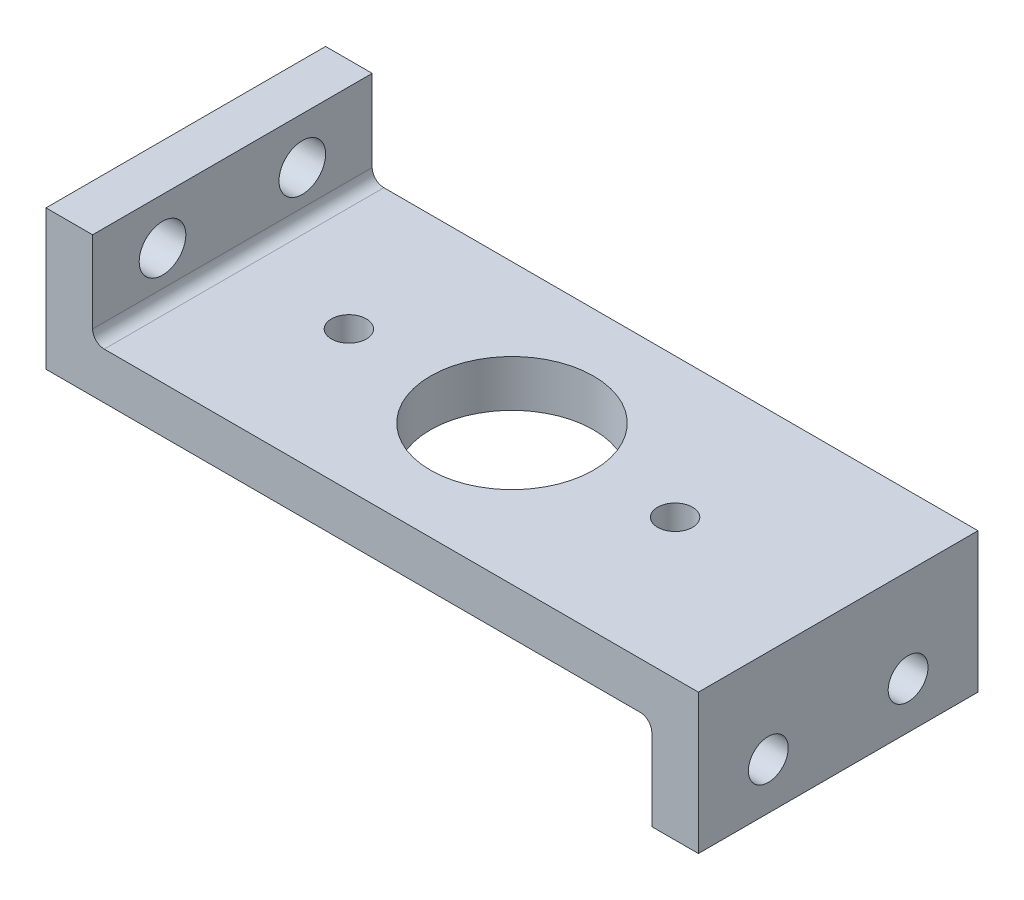
ISO-10303-21;
HEADER;
FILE_DESCRIPTION(('STEP AP214'),'2;1');
FILE_NAME('part.step','',(''),(''),'','','');
FILE_SCHEMA(('AUTOMOTIVE_DESIGN { 1 0 10303 214 1 1 1 1 }'));
ENDSEC;
DATA;
#1=APPLICATION_CONTEXT('core data for automotive mechanical design processes');
#2=APPLICATION_PROTOCOL_DEFINITION('international standard','automotive_design',2000,#1);
#3=PRODUCT_CONTEXT('',#1,'mechanical');
#4=PRODUCT('Part','Part','',(#3));
#5=PRODUCT_RELATED_PRODUCT_CATEGORY('part','',(#4));
#6=PRODUCT_DEFINITION_FORMATION('','',#4);
#7=PRODUCT_DEFINITION_CONTEXT('part definition',#1,'design');
#8=PRODUCT_DEFINITION('design','',#6,#7);
#9=PRODUCT_DEFINITION_SHAPE('','',#8);
#10=(LENGTH_UNIT() NAMED_UNIT(*) SI_UNIT(.MILLI.,.METRE.));
#11=(NAMED_UNIT(*) PLANE_ANGLE_UNIT() SI_UNIT($,.RADIAN.));
#12=(NAMED_UNIT(*) SI_UNIT($,.STERADIAN.) SOLID_ANGLE_UNIT());
#13=UNCERTAINTY_MEASURE_WITH_UNIT(LENGTH_MEASURE(1.E-05),#10,'distance_accuracy_value','');
#14=(GEOMETRIC_REPRESENTATION_CONTEXT(3) GLOBAL_UNCERTAINTY_ASSIGNED_CONTEXT((#13)) GLOBAL_UNIT_ASSIGNED_CONTEXT((#10,
#11,#12)) REPRESENTATION_CONTEXT('',''));
#15=CARTESIAN_POINT('',(0.,0.,0.));
#16=DIRECTION('',(0.,0.,1.));
#17=DIRECTION('',(1.,0.,0.));
#18=AXIS2_PLACEMENT_3D('',#15,#16,#17);
#19=CARTESIAN_POINT('',(-73.0250000000001,7.80727615005251,76.2));
#20=DIRECTION('',(0.,-1.,0.));
#21=DIRECTION('',(1.,0.,0.));
#22=AXIS2_PLACEMENT_3D('',#19,#20,#21);
#23=PLANE('',#22);
#24=CARTESIAN_POINT('',(44.4499999999999,7.80727615005251,38.1));
#25=DIRECTION('',(0.,-1.,0.));
#26=DIRECTION('',(1.,0.,0.));
#27=AXIS2_PLACEMENT_3D('',#24,#25,#26);
#28=CIRCLE('',#27,4.7625);
#29=CARTESIAN_POINT('',(49.2124999999999,7.80727615005251,38.1));
#30=VERTEX_POINT('',#29);
#31=EDGE_CURVE('E164',#30,#30,#28,.T.);
#32=ORIENTED_EDGE('',*,*,#31,.T.);
#33=EDGE_LOOP('',(#32));
#34=FACE_BOUND('',#33,.T.);
#35=CARTESIAN_POINT('',(-44.4500000000001,7.80727615005251,38.1));
#36=DIRECTION('',(0.,-1.,0.));
#37=DIRECTION('',(1.,0.,0.));
#38=AXIS2_PLACEMENT_3D('',#35,#36,#37);
#39=CIRCLE('',#38,4.7625);
#40=CARTESIAN_POINT('',(-39.6875000000001,7.80727615005251,38.1));
#41=VERTEX_POINT('',#40);
#42=EDGE_CURVE('E203',#41,#41,#39,.T.);
#43=ORIENTED_EDGE('',*,*,#42,.T.);
#44=EDGE_LOOP('',(#43));
#45=FACE_BOUND('',#44,.T.);
#46=CARTESIAN_POINT('',(0.,7.80727615005251,38.1));
#47=DIRECTION('',(0.,-1.,0.));
#48=DIRECTION('',(1.,0.,0.));
#49=AXIS2_PLACEMENT_3D('',#46,#47,#48);
#50=CIRCLE('',#49,22.225);
#51=CARTESIAN_POINT('',(22.2249999999999,7.80727615005251,38.1));
#52=VERTEX_POINT('',#51);
#53=EDGE_CURVE('E199',#52,#52,#50,.T.);
#54=ORIENTED_EDGE('',*,*,#53,.T.);
#55=EDGE_LOOP('',(#54));
#56=FACE_BOUND('',#55,.T.);
#57=DIRECTION('',(-1.,0.,0.));
#58=VECTOR('',#57,1.);
#59=CARTESIAN_POINT('',(-73.0250000000001,7.80727615005251,0.));
#60=LINE('',#59,#58);
#61=CARTESIAN_POINT('',(88.8999999999999,7.80727615005251,0.));
#62=VERTEX_POINT('',#61);
#63=CARTESIAN_POINT('',(-73.0250000000001,7.80727615005251,0.));
#64=VERTEX_POINT('',#63);
#65=EDGE_CURVE('E161',#62,#64,#60,.T.);
#66=ORIENTED_EDGE('',*,*,#65,.T.);
#67=DIRECTION('',(0.,0.,-1.));
#68=VECTOR('',#67,1.);
#69=CARTESIAN_POINT('',(-73.0250000000001,7.80727615005251,76.2));
#70=LINE('',#69,#68);
#71=CARTESIAN_POINT('',(-73.0250000000001,7.80727615005251,76.2));
#72=VERTEX_POINT('',#71);
#73=EDGE_CURVE('E56',#72,#64,#70,.T.);
#74=ORIENTED_EDGE('',*,*,#73,.F.);
#75=DIRECTION('',(-1.,0.,0.));
#76=VECTOR('',#75,1.);
#77=CARTESIAN_POINT('',(-73.0250000000001,7.80727615005251,76.2));
#78=LINE('',#77,#76);
#79=CARTESIAN_POINT('',(88.8999999999999,7.80727615005251,76.2));
#80=VERTEX_POINT('',#79);
#81=EDGE_CURVE('E115',#80,#72,#78,.T.);
#82=ORIENTED_EDGE('',*,*,#81,.F.);
#83=DIRECTION('',(0.,0.,-1.));
#84=VECTOR('',#83,1.);
#85=CARTESIAN_POINT('',(88.8999999999999,7.80727615005251,76.2));
#86=LINE('',#85,#84);
#87=EDGE_CURVE('E13',#80,#62,#86,.T.);
#88=ORIENTED_EDGE('',*,*,#87,.T.);
#89=EDGE_LOOP('',(#66,#74,#82,#88));
#90=FACE_BOUND('',#89,.T.);
#91=ADVANCED_FACE('F47',(#34,#45,#56,#90),#23,.F.);
#92=CARTESIAN_POINT('',(-73.0250000000001,10.9822761500525,76.2));
#93=DIRECTION('',(0.,0.,-1.));
#94=DIRECTION('',(-1.,0.,0.));
#95=AXIS2_PLACEMENT_3D('',#92,#93,#94);
#96=CYLINDRICAL_SURFACE('',#95,3.175);
#97=CARTESIAN_POINT('',(-73.0250000000001,10.9822761500525,0.));
#98=DIRECTION('',(0.,0.,-1.));
#99=DIRECTION('',(-1.,0.,0.));
#100=AXIS2_PLACEMENT_3D('',#97,#98,#99);
#101=CIRCLE('',#100,3.175);
#102=CARTESIAN_POINT('',(-76.2000000000001,10.9822761500525,0.));
#103=VERTEX_POINT('',#102);
#104=EDGE_CURVE('E163',#64,#103,#101,.T.);
#105=ORIENTED_EDGE('',*,*,#104,.T.);
#106=DIRECTION('',(0.,0.,-1.));
#107=VECTOR('',#106,1.);
#108=CARTESIAN_POINT('',(-76.2000000000001,10.9822761500525,76.2));
#109=LINE('',#108,#107);
#110=CARTESIAN_POINT('',(-76.2000000000001,10.9822761500525,76.2));
#111=VERTEX_POINT('',#110);
#112=EDGE_CURVE('E192',#111,#103,#109,.T.);
#113=ORIENTED_EDGE('',*,*,#112,.F.);
#114=CARTESIAN_POINT('',(-73.0250000000001,10.9822761500525,76.2));
#115=DIRECTION('',(0.,0.,-1.));
#116=DIRECTION('',(-1.,0.,0.));
#117=AXIS2_PLACEMENT_3D('',#114,#115,#116);
#118=CIRCLE('',#117,3.175);
#119=EDGE_CURVE('E220',#72,#111,#118,.T.);
#120=ORIENTED_EDGE('',*,*,#119,.F.);
#121=ORIENTED_EDGE('',*,*,#73,.T.);
#122=EDGE_LOOP('',(#105,#113,#120,#121));
#123=FACE_BOUND('',#122,.T.);
#124=ADVANCED_FACE('F246',(#123),#96,.F.);
#125=CARTESIAN_POINT('',(-76.2000000000001,10.9822761500525,76.2));
#126=DIRECTION('',(-1.,0.,0.));
#127=DIRECTION('',(0.,0.,1.));
#128=AXIS2_PLACEMENT_3D('',#125,#126,#127);
#129=PLANE('',#128);
#130=CARTESIAN_POINT('',(-76.2000000000001,20.5072761500525,19.05));
#131=DIRECTION('',(-1.,0.,0.));
#132=DIRECTION('',(0.,0.,1.));
#133=AXIS2_PLACEMENT_3D('',#130,#131,#132);
#134=CIRCLE('',#133,6.35);
#135=CARTESIAN_POINT('',(-76.2000000000001,20.5072761500525,25.4));
#136=VERTEX_POINT('',#135);
#137=EDGE_CURVE('E200',#136,#136,#134,.F.);
#138=ORIENTED_EDGE('',*,*,#137,.F.);
#139=EDGE_LOOP('',(#138));
#140=FACE_BOUND('',#139,.T.);
#141=CARTESIAN_POINT('',(-76.2000000000001,20.5072761500525,57.15));
#142=DIRECTION('',(-1.,0.,0.));
#143=DIRECTION('',(0.,0.,1.));
#144=AXIS2_PLACEMENT_3D('',#141,#142,#143);
#145=CIRCLE('',#144,6.35000000000001);
#146=CARTESIAN_POINT('',(-76.2000000000001,20.5072761500525,63.5));
#147=VERTEX_POINT('',#146);
#148=EDGE_CURVE('E213',#147,#147,#145,.F.);
#149=ORIENTED_EDGE('',*,*,#148,.F.);
#150=EDGE_LOOP('',(#149));
#151=FACE_BOUND('',#150,.T.);
#152=DIRECTION('',(0.,1.,0.));
#153=VECTOR('',#152,1.);
#154=CARTESIAN_POINT('',(-76.2000000000001,10.9822761500525,0.));
#155=LINE('',#154,#153);
#156=CARTESIAN_POINT('',(-76.2000000000001,33.2072761500525,0.));
#157=VERTEX_POINT('',#156);
#158=EDGE_CURVE('E166',#103,#157,#155,.T.);
#159=ORIENTED_EDGE('',*,*,#158,.T.);
#160=DIRECTION('',(0.,0.,-1.));
#161=VECTOR('',#160,1.);
#162=CARTESIAN_POINT('',(-76.2000000000001,33.2072761500525,76.2));
#163=LINE('',#162,#161);
#164=CARTESIAN_POINT('',(-76.2000000000001,33.2072761500525,76.2));
#165=VERTEX_POINT('',#164);
#166=EDGE_CURVE('E189',#165,#157,#163,.T.);
#167=ORIENTED_EDGE('',*,*,#166,.F.);
#168=DIRECTION('',(0.,1.,0.));
#169=VECTOR('',#168,1.);
#170=CARTESIAN_POINT('',(-76.2000000000001,10.9822761500525,76.2));
#171=LINE('',#170,#169);
#172=EDGE_CURVE('E222',#111,#165,#171,.T.);
#173=ORIENTED_EDGE('',*,*,#172,.F.);
#174=ORIENTED_EDGE('',*,*,#112,.T.);
#175=EDGE_LOOP('',(#159,#167,#173,#174));
#176=FACE_BOUND('',#175,.T.);
#177=ADVANCED_FACE('F251',(#140,#151,#176),#129,.F.);
#178=CARTESIAN_POINT('',(-88.9000000000001,33.2072761500525,76.2));
#179=DIRECTION('',(0.,-1.,0.));
#180=DIRECTION('',(0.,0.,-1.));
#181=AXIS2_PLACEMENT_3D('',#178,#179,#180);
#182=PLANE('',#181);
#183=DIRECTION('',(-1.,0.,0.));
#184=VECTOR('',#183,1.);
#185=CARTESIAN_POINT('',(-88.9000000000001,33.2072761500525,0.));
#186=LINE('',#185,#184);
#187=CARTESIAN_POINT('',(-88.9000000000001,33.2072761500525,0.));
#188=VERTEX_POINT('',#187);
#189=EDGE_CURVE('E168',#157,#188,#186,.T.);
#190=ORIENTED_EDGE('',*,*,#189,.T.);
#191=DIRECTION('',(0.,0.,-1.));
#192=VECTOR('',#191,1.);
#193=CARTESIAN_POINT('',(-88.9000000000001,33.2072761500525,76.2));
#194=LINE('',#193,#192);
#195=CARTESIAN_POINT('',(-88.9000000000001,33.2072761500525,76.2));
#196=VERTEX_POINT('',#195);
#197=EDGE_CURVE('E186',#196,#188,#194,.T.);
#198=ORIENTED_EDGE('',*,*,#197,.F.);
#199=DIRECTION('',(-1.,0.,0.));
#200=VECTOR('',#199,1.);
#201=CARTESIAN_POINT('',(-88.9000000000001,33.2072761500525,76.2));
#202=LINE('',#201,#200);
#203=EDGE_CURVE('E224',#165,#196,#202,.T.);
#204=ORIENTED_EDGE('',*,*,#203,.F.);
#205=ORIENTED_EDGE('',*,*,#166,.T.);
#206=EDGE_LOOP('',(#190,#198,#204,#205));
#207=FACE_BOUND('',#206,.T.);
#208=ADVANCED_FACE('F254',(#207),#182,.F.);
#209=CARTESIAN_POINT('',(-88.9000000000001,-4.89272384994749,76.2));
#210=DIRECTION('',(1.,0.,0.));
#211=DIRECTION('',(0.,0.,-1.));
#212=AXIS2_PLACEMENT_3D('',#209,#210,#211);
#213=PLANE('',#212);
#214=CARTESIAN_POINT('',(-88.9000000000001,20.5072761500525,19.05));
#215=DIRECTION('',(-1.,0.,0.));
#216=DIRECTION('',(0.,0.,1.));
#217=AXIS2_PLACEMENT_3D('',#214,#215,#216);
#218=CIRCLE('',#217,6.35);
#219=CARTESIAN_POINT('',(-88.9000000000001,20.5072761500525,25.4));
#220=VERTEX_POINT('',#219);
#221=EDGE_CURVE('E425',#220,#220,#218,.T.);
#222=ORIENTED_EDGE('',*,*,#221,.F.);
#223=EDGE_LOOP('',(#222));
#224=FACE_BOUND('',#223,.T.);
#225=CARTESIAN_POINT('',(-88.9000000000001,20.5072761500525,57.15));
#226=DIRECTION('',(-1.,0.,0.));
#227=DIRECTION('',(0.,0.,1.));
#228=AXIS2_PLACEMENT_3D('',#225,#226,#227);
#229=CIRCLE('',#228,6.35000000000001);
#230=CARTESIAN_POINT('',(-88.9000000000001,20.5072761500525,63.5));
#231=VERTEX_POINT('',#230);
#232=EDGE_CURVE('E417',#231,#231,#229,.T.);
#233=ORIENTED_EDGE('',*,*,#232,.F.);
#234=EDGE_LOOP('',(#233));
#235=FACE_BOUND('',#234,.T.);
#236=DIRECTION('',(0.,-1.,0.));
#237=VECTOR('',#236,1.);
#238=CARTESIAN_POINT('',(-88.9000000000001,-4.89272384994749,0.));
#239=LINE('',#238,#237);
#240=CARTESIAN_POINT('',(-88.9000000000001,-4.89272384994749,0.));
#241=VERTEX_POINT('',#240);
#242=EDGE_CURVE('E171',#188,#241,#239,.T.);
#243=ORIENTED_EDGE('',*,*,#242,.T.);
#244=DIRECTION('',(0.,0.,-1.));
#245=VECTOR('',#244,1.);
#246=CARTESIAN_POINT('',(-88.9000000000001,-4.89272384994749,76.2));
#247=LINE('',#246,#245);
#248=CARTESIAN_POINT('',(-88.9000000000001,-4.89272384994749,76.2));
#249=VERTEX_POINT('',#248);
#250=EDGE_CURVE('E183',#249,#241,#247,.T.);
#251=ORIENTED_EDGE('',*,*,#250,.F.);
#252=DIRECTION('',(0.,-1.,0.));
#253=VECTOR('',#252,1.);
#254=CARTESIAN_POINT('',(-88.9000000000001,4.89272384994749,76.2));
#255=LINE('',#254,#253);
#256=EDGE_CURVE('E226',#196,#249,#255,.T.);
#257=ORIENTED_EDGE('',*,*,#256,.F.);
#258=ORIENTED_EDGE('',*,*,#197,.T.);
#259=EDGE_LOOP('',(#243,#251,#257,#258));
#260=FACE_BOUND('',#259,.T.);
#261=ADVANCED_FACE('F232',(#224,#235,#260),#213,.F.);
#262=CARTESIAN_POINT('',(-88.9000000000001,-4.89272384994749,76.2));
#263=DIRECTION('',(0.,1.,0.));
#264=DIRECTION('',(-1.,0.,0.));
#265=AXIS2_PLACEMENT_3D('',#262,#263,#264);
#266=PLANE('',#265);
#267=CARTESIAN_POINT('',(44.4499999999999,-4.89272384994748,38.1));
#268=DIRECTION('',(0.,1.,0.));
#269=DIRECTION('',(-1.,0.,0.));
#270=AXIS2_PLACEMENT_3D('',#267,#268,#269);
#271=CIRCLE('',#270,4.7625);
#272=CARTESIAN_POINT('',(39.6874999999999,-4.89272384994748,38.1));
#273=VERTEX_POINT('',#272);
#274=EDGE_CURVE('E50',#273,#273,#271,.T.);
#275=ORIENTED_EDGE('',*,*,#274,.T.);
#276=EDGE_LOOP('',(#275));
#277=FACE_BOUND('',#276,.T.);
#278=CARTESIAN_POINT('',(-44.4500000000001,-4.89272384994749,38.1));
#279=DIRECTION('',(0.,1.,0.));
#280=DIRECTION('',(-1.,0.,0.));
#281=AXIS2_PLACEMENT_3D('',#278,#279,#280);
#282=CIRCLE('',#281,4.7625);
#283=CARTESIAN_POINT('',(-49.2125000000001,-4.89272384994749,38.1));
#284=VERTEX_POINT('',#283);
#285=EDGE_CURVE('E201',#284,#284,#282,.T.);
#286=ORIENTED_EDGE('',*,*,#285,.T.);
#287=EDGE_LOOP('',(#286));
#288=FACE_BOUND('',#287,.T.);
#289=CARTESIAN_POINT('',(0.,-4.89272384994749,38.1));
#290=DIRECTION('',(0.,1.,0.));
#291=DIRECTION('',(-1.,0.,0.));
#292=AXIS2_PLACEMENT_3D('',#289,#290,#291);
#293=CIRCLE('',#292,22.225);
#294=CARTESIAN_POINT('',(-22.2250000000001,-4.89272384994749,38.1));
#295=VERTEX_POINT('',#294);
#296=EDGE_CURVE('E197',#295,#295,#293,.T.);
#297=ORIENTED_EDGE('',*,*,#296,.T.);
#298=EDGE_LOOP('',(#297));
#299=FACE_BOUND('',#298,.T.);
#300=DIRECTION('',(1.,0.,0.));
#301=VECTOR('',#300,1.);
#302=CARTESIAN_POINT('',(-88.9000000000001,-4.89272384994749,0.));
#303=LINE('',#302,#301);
#304=CARTESIAN_POINT('',(73.0249999999999,-4.89272384994748,0.));
#305=VERTEX_POINT('',#304);
#306=EDGE_CURVE('E173',#241,#305,#303,.T.);
#307=ORIENTED_EDGE('',*,*,#306,.T.);
#308=DIRECTION('',(0.,0.,-1.));
#309=VECTOR('',#308,1.);
#310=CARTESIAN_POINT('',(73.0249999999999,-4.89272384994748,76.2));
#311=LINE('',#310,#309);
#312=CARTESIAN_POINT('',(73.0249999999999,-4.89272384994748,76.2));
#313=VERTEX_POINT('',#312);
#314=EDGE_CURVE('E150',#313,#305,#311,.T.);
#315=ORIENTED_EDGE('',*,*,#314,.F.);
#316=DIRECTION('',(1.,0.,0.));
#317=VECTOR('',#316,1.);
#318=CARTESIAN_POINT('',(-88.9000000000001,-4.89272384994749,76.2));
#319=LINE('',#318,#317);
#320=EDGE_CURVE('E141',#249,#313,#319,.T.);
#321=ORIENTED_EDGE('',*,*,#320,.F.);
#322=ORIENTED_EDGE('',*,*,#250,.T.);
#323=EDGE_LOOP('',(#307,#315,#321,#322));
#324=FACE_BOUND('',#323,.T.);
#325=ADVANCED_FACE('F235',(#277,#288,#299,#324),#266,.F.);
#326=CARTESIAN_POINT('',(73.0249999999999,-8.06772384994748,76.2));
#327=DIRECTION('',(0.,0.,-1.));
#328=DIRECTION('',(-1.,0.,0.));
#329=AXIS2_PLACEMENT_3D('',#326,#327,#328);
#330=CYLINDRICAL_SURFACE('',#329,3.175);
#331=CARTESIAN_POINT('',(73.0249999999999,-8.06772384994748,0.));
#332=DIRECTION('',(0.,0.,-1.));
#333=DIRECTION('',(1.,0.,0.));
#334=AXIS2_PLACEMENT_3D('',#331,#332,#333);
#335=CIRCLE('',#334,3.175);
#336=CARTESIAN_POINT('',(76.1999999999999,-8.06772384994751,0.));
#337=VERTEX_POINT('',#336);
#338=EDGE_CURVE('E149',#305,#337,#335,.T.);
#339=ORIENTED_EDGE('',*,*,#338,.T.);
#340=DIRECTION('',(0.,0.,-1.));
#341=VECTOR('',#340,1.);
#342=CARTESIAN_POINT('',(76.1999999999999,-8.06772384994751,76.2));
#343=LINE('',#342,#341);
#344=CARTESIAN_POINT('',(76.1999999999999,-8.06772384994751,76.2));
#345=VERTEX_POINT('',#344);
#346=EDGE_CURVE('E146',#345,#337,#343,.T.);
#347=ORIENTED_EDGE('',*,*,#346,.F.);
#348=CARTESIAN_POINT('',(73.0249999999999,-8.06772384994748,76.2));
#349=DIRECTION('',(0.,0.,-1.));
#350=DIRECTION('',(1.,0.,0.));
#351=AXIS2_PLACEMENT_3D('',#348,#349,#350);
#352=CIRCLE('',#351,3.175);
#353=EDGE_CURVE('E135',#313,#345,#352,.T.);
#354=ORIENTED_EDGE('',*,*,#353,.F.);
#355=ORIENTED_EDGE('',*,*,#314,.T.);
#356=EDGE_LOOP('',(#339,#347,#354,#355));
#357=FACE_BOUND('',#356,.T.);
#358=ADVANCED_FACE('F147',(#357),#330,.F.);
#359=CARTESIAN_POINT('',(76.1999999999999,-8.0677238499475,76.2));
#360=DIRECTION('',(1.,0.,0.));
#361=DIRECTION('',(0.,0.,-1.));
#362=AXIS2_PLACEMENT_3D('',#359,#360,#361);
#363=PLANE('',#362);
#364=CARTESIAN_POINT('',(76.1999999999999,-17.5927238499475,57.15));
#365=DIRECTION('',(1.,0.,0.));
#366=DIRECTION('',(0.,0.,-1.));
#367=AXIS2_PLACEMENT_3D('',#364,#365,#366);
#368=CIRCLE('',#367,5.42839257087166);
#369=CARTESIAN_POINT('',(76.1999999999999,-17.5927238499475,51.7216074291283));
#370=VERTEX_POINT('',#369);
#371=EDGE_CURVE('E416',#370,#370,#368,.T.);
#372=ORIENTED_EDGE('',*,*,#371,.T.);
#373=EDGE_LOOP('',(#372));
#374=FACE_BOUND('',#373,.T.);
#375=CARTESIAN_POINT('',(76.1999999999999,-17.5927238499475,19.05));
#376=DIRECTION('',(1.,0.,0.));
#377=DIRECTION('',(0.,0.,-1.));
#378=AXIS2_PLACEMENT_3D('',#375,#376,#377);
#379=CIRCLE('',#378,5.42839257087166);
#380=CARTESIAN_POINT('',(76.1999999999999,-17.5927238499475,13.6216074291283));
#381=VERTEX_POINT('',#380);
#382=EDGE_CURVE('E418',#381,#381,#379,.T.);
#383=ORIENTED_EDGE('',*,*,#382,.T.);
#384=EDGE_LOOP('',(#383));
#385=FACE_BOUND('',#384,.T.);
#386=DIRECTION('',(0.,-1.,0.));
#387=VECTOR('',#386,1.);
#388=CARTESIAN_POINT('',(76.1999999999999,-8.0677238499475,0.));
#389=LINE('',#388,#387);
#390=CARTESIAN_POINT('',(76.1999999999999,-30.2927238499475,0.));
#391=VERTEX_POINT('',#390);
#392=EDGE_CURVE('E101',#337,#391,#389,.T.);
#393=ORIENTED_EDGE('',*,*,#392,.T.);
#394=DIRECTION('',(0.,0.,-1.));
#395=VECTOR('',#394,1.);
#396=CARTESIAN_POINT('',(76.1999999999999,-30.2927238499475,76.2));
#397=LINE('',#396,#395);
#398=CARTESIAN_POINT('',(76.1999999999999,-30.2927238499475,76.2));
#399=VERTEX_POINT('',#398);
#400=EDGE_CURVE('E151',#399,#391,#397,.T.);
#401=ORIENTED_EDGE('',*,*,#400,.F.);
#402=DIRECTION('',(0.,-1.,0.));
#403=VECTOR('',#402,1.);
#404=CARTESIAN_POINT('',(76.1999999999999,-8.0677238499475,76.2));
#405=LINE('',#404,#403);
#406=EDGE_CURVE('E139',#345,#399,#405,.T.);
#407=ORIENTED_EDGE('',*,*,#406,.F.);
#408=ORIENTED_EDGE('',*,*,#346,.T.);
#409=EDGE_LOOP('',(#393,#401,#407,#408));
#410=FACE_BOUND('',#409,.T.);
#411=ADVANCED_FACE('F153',(#374,#385,#410),#363,.F.);
#412=CARTESIAN_POINT('',(88.8999999999999,-30.2927238499475,76.2));
#413=DIRECTION('',(0.,1.,0.));
#414=DIRECTION('',(-1.,0.,0.));
#415=AXIS2_PLACEMENT_3D('',#412,#413,#414);
#416=PLANE('',#415);
#417=DIRECTION('',(1.,0.,0.));
#418=VECTOR('',#417,1.);
#419=CARTESIAN_POINT('',(88.8999999999999,-30.2927238499475,0.));
#420=LINE('',#419,#418);
#421=CARTESIAN_POINT('',(88.8999999999999,-30.2927238499475,0.));
#422=VERTEX_POINT('',#421);
#423=EDGE_CURVE('E108',#391,#422,#420,.T.);
#424=ORIENTED_EDGE('',*,*,#423,.T.);
#425=DIRECTION('',(0.,0.,-1.));
#426=VECTOR('',#425,1.);
#427=CARTESIAN_POINT('',(88.8999999999999,-30.2927238499475,76.2));
#428=LINE('',#427,#426);
#429=CARTESIAN_POINT('',(88.8999999999999,-30.2927238499475,76.2));
#430=VERTEX_POINT('',#429);
#431=EDGE_CURVE('E157',#430,#422,#428,.T.);
#432=ORIENTED_EDGE('',*,*,#431,.F.);
#433=DIRECTION('',(1.,0.,0.));
#434=VECTOR('',#433,1.);
#435=CARTESIAN_POINT('',(88.8999999999999,-30.2927238499475,76.2));
#436=LINE('',#435,#434);
#437=EDGE_CURVE('E155',#399,#430,#436,.T.);
#438=ORIENTED_EDGE('',*,*,#437,.F.);
#439=ORIENTED_EDGE('',*,*,#400,.T.);
#440=EDGE_LOOP('',(#424,#432,#438,#439));
#441=FACE_BOUND('',#440,.T.);
#442=ADVANCED_FACE('F242',(#441),#416,.F.);
#443=CARTESIAN_POINT('',(88.8999999999999,-4.89272384994748,76.2));
#444=DIRECTION('',(-1.,0.,0.));
#445=DIRECTION('',(0.,-1.,0.));
#446=AXIS2_PLACEMENT_3D('',#443,#444,#445);
#447=PLANE('',#446);
#448=CARTESIAN_POINT('',(88.8999999999999,-17.5927238499475,57.15));
#449=DIRECTION('',(1.,0.,0.));
#450=DIRECTION('',(0.,1.,0.));
#451=AXIS2_PLACEMENT_3D('',#448,#449,#450);
#452=CIRCLE('',#451,5.42839257087166);
#453=CARTESIAN_POINT('',(88.8999999999999,-12.1643312790758,57.15));
#454=VERTEX_POINT('',#453);
#455=EDGE_CURVE('E413',#454,#454,#452,.T.);
#456=ORIENTED_EDGE('',*,*,#455,.F.);
#457=EDGE_LOOP('',(#456));
#458=FACE_BOUND('',#457,.T.);
#459=CARTESIAN_POINT('',(88.8999999999999,-17.5927238499475,19.05));
#460=DIRECTION('',(1.,0.,0.));
#461=DIRECTION('',(0.,1.,0.));
#462=AXIS2_PLACEMENT_3D('',#459,#460,#461);
#463=CIRCLE('',#462,5.42839257087166);
#464=CARTESIAN_POINT('',(88.8999999999999,-12.1643312790758,19.05));
#465=VERTEX_POINT('',#464);
#466=EDGE_CURVE('E438',#465,#465,#463,.T.);
#467=ORIENTED_EDGE('',*,*,#466,.F.);
#468=EDGE_LOOP('',(#467));
#469=FACE_BOUND('',#468,.T.);
#470=DIRECTION('',(0.,1.,0.));
#471=VECTOR('',#470,1.);
#472=CARTESIAN_POINT('',(88.8999999999999,-4.89272384994748,0.));
#473=LINE('',#472,#471);
#474=EDGE_CURVE('E178',#422,#62,#473,.T.);
#475=ORIENTED_EDGE('',*,*,#474,.T.);
#476=ORIENTED_EDGE('',*,*,#87,.F.);
#477=DIRECTION('',(0.,1.,0.));
#478=VECTOR('',#477,1.);
#479=CARTESIAN_POINT('',(88.8999999999999,-4.89272384994748,76.2));
#480=LINE('',#479,#478);
#481=EDGE_CURVE('E65',#430,#80,#480,.T.);
#482=ORIENTED_EDGE('',*,*,#481,.F.);
#483=ORIENTED_EDGE('',*,*,#431,.T.);
#484=EDGE_LOOP('',(#475,#476,#482,#483));
#485=FACE_BOUND('',#484,.T.);
#486=ADVANCED_FACE('F241',(#458,#469,#485),#447,.F.);
#487=CARTESIAN_POINT('',(-73.0250000000001,10.9822761500525,76.2));
#488=DIRECTION('',(0.,0.,-1.));
#489=DIRECTION('',(-1.,0.,0.));
#490=AXIS2_PLACEMENT_3D('',#487,#488,#489);
#491=PLANE('',#490);
#492=ORIENTED_EDGE('',*,*,#481,.T.);
#493=ORIENTED_EDGE('',*,*,#81,.T.);
#494=ORIENTED_EDGE('',*,*,#119,.T.);
#495=ORIENTED_EDGE('',*,*,#172,.T.);
#496=ORIENTED_EDGE('',*,*,#203,.T.);
#497=ORIENTED_EDGE('',*,*,#256,.T.);
#498=ORIENTED_EDGE('',*,*,#320,.T.);
#499=ORIENTED_EDGE('',*,*,#353,.T.);
#500=ORIENTED_EDGE('',*,*,#406,.T.);
#501=ORIENTED_EDGE('',*,*,#437,.T.);
#502=EDGE_LOOP('',(#492,#493,#494,#495,#496,#497,#498,#499,#500,#501));
#503=FACE_BOUND('',#502,.T.);
#504=ADVANCED_FACE('F137',(#503),#491,.F.);
#505=CARTESIAN_POINT('',(-73.0250000000001,10.9822761500525,0.));
#506=DIRECTION('',(0.,0.,-1.));
#507=DIRECTION('',(-1.,0.,0.));
#508=AXIS2_PLACEMENT_3D('',#505,#506,#507);
#509=PLANE('',#508);
#510=ORIENTED_EDGE('',*,*,#65,.F.);
#511=ORIENTED_EDGE('',*,*,#474,.F.);
#512=ORIENTED_EDGE('',*,*,#423,.F.);
#513=ORIENTED_EDGE('',*,*,#392,.F.);
#514=ORIENTED_EDGE('',*,*,#338,.F.);
#515=ORIENTED_EDGE('',*,*,#306,.F.);
#516=ORIENTED_EDGE('',*,*,#242,.F.);
#517=ORIENTED_EDGE('',*,*,#189,.F.);
#518=ORIENTED_EDGE('',*,*,#158,.F.);
#519=ORIENTED_EDGE('',*,*,#104,.F.);
#520=EDGE_LOOP('',(#510,#511,#512,#513,#514,#515,#516,#517,#518,#519));
#521=FACE_BOUND('',#520,.T.);
#522=ADVANCED_FACE('F238',(#521),#509,.T.);
#523=CARTESIAN_POINT('',(0.,-30.2927238499475,38.1));
#524=DIRECTION('',(0.,1.,0.));
#525=DIRECTION('',(0.,0.,1.));
#526=AXIS2_PLACEMENT_3D('',#523,#524,#525);
#527=CYLINDRICAL_SURFACE('',#526,22.225);
#528=ORIENTED_EDGE('',*,*,#296,.F.);
#529=EDGE_LOOP('',(#528));
#530=FACE_BOUND('',#529,.T.);
#531=ORIENTED_EDGE('',*,*,#53,.F.);
#532=EDGE_LOOP('',(#531));
#533=FACE_BOUND('',#532,.T.);
#534=ADVANCED_FACE('F277',(#530,#533),#527,.F.);
#535=CARTESIAN_POINT('',(-44.4500000000001,-30.2927238499475,38.1));
#536=DIRECTION('',(0.,1.,0.));
#537=DIRECTION('',(0.,0.,1.));
#538=AXIS2_PLACEMENT_3D('',#535,#536,#537);
#539=CYLINDRICAL_SURFACE('',#538,4.7625);
#540=ORIENTED_EDGE('',*,*,#285,.F.);
#541=EDGE_LOOP('',(#540));
#542=FACE_BOUND('',#541,.T.);
#543=ORIENTED_EDGE('',*,*,#42,.F.);
#544=EDGE_LOOP('',(#543));
#545=FACE_BOUND('',#544,.T.);
#546=ADVANCED_FACE('F274',(#542,#545),#539,.F.);
#547=CARTESIAN_POINT('',(44.4499999999999,-30.2927238499475,38.1));
#548=DIRECTION('',(0.,1.,0.));
#549=DIRECTION('',(0.,0.,1.));
#550=AXIS2_PLACEMENT_3D('',#547,#548,#549);
#551=CYLINDRICAL_SURFACE('',#550,4.7625);
#552=ORIENTED_EDGE('',*,*,#274,.F.);
#553=EDGE_LOOP('',(#552));
#554=FACE_BOUND('',#553,.T.);
#555=ORIENTED_EDGE('',*,*,#31,.F.);
#556=EDGE_LOOP('',(#555));
#557=FACE_BOUND('',#556,.T.);
#558=ADVANCED_FACE('F276',(#554,#557),#551,.F.);
#559=CARTESIAN_POINT('',(88.9009999999999,20.5072761500525,57.15));
#560=DIRECTION('',(-1.,0.,0.));
#561=DIRECTION('',(0.,0.,1.));
#562=AXIS2_PLACEMENT_3D('',#559,#560,#561);
#563=CYLINDRICAL_SURFACE('',#562,6.35000000000001);
#564=ORIENTED_EDGE('',*,*,#232,.T.);
#565=EDGE_LOOP('',(#564));
#566=FACE_BOUND('',#565,.T.);
#567=ORIENTED_EDGE('',*,*,#148,.T.);
#568=EDGE_LOOP('',(#567));
#569=FACE_BOUND('',#568,.T.);
#570=ADVANCED_FACE('F284',(#566,#569),#563,.F.);
#571=CARTESIAN_POINT('',(88.9009999999999,20.5072761500525,19.05));
#572=DIRECTION('',(-1.,0.,0.));
#573=DIRECTION('',(0.,0.,1.));
#574=AXIS2_PLACEMENT_3D('',#571,#572,#573);
#575=CYLINDRICAL_SURFACE('',#574,6.35);
#576=ORIENTED_EDGE('',*,*,#221,.T.);
#577=EDGE_LOOP('',(#576));
#578=FACE_BOUND('',#577,.T.);
#579=ORIENTED_EDGE('',*,*,#137,.T.);
#580=EDGE_LOOP('',(#579));
#581=FACE_BOUND('',#580,.T.);
#582=ADVANCED_FACE('F379',(#578,#581),#575,.F.);
#583=CARTESIAN_POINT('',(12.6999999999999,-17.5927238499475,19.05));
#584=DIRECTION('',(1.,0.,0.));
#585=DIRECTION('',(0.,1.,0.));
#586=AXIS2_PLACEMENT_3D('',#583,#584,#585);
#587=CYLINDRICAL_SURFACE('',#586,5.42839257087166);
#588=ORIENTED_EDGE('',*,*,#466,.T.);
#589=EDGE_LOOP('',(#588));
#590=FACE_BOUND('',#589,.T.);
#591=ORIENTED_EDGE('',*,*,#382,.F.);
#592=EDGE_LOOP('',(#591));
#593=FACE_BOUND('',#592,.T.);
#594=ADVANCED_FACE('F387',(#590,#593),#587,.F.);
#595=CARTESIAN_POINT('',(12.6999999999999,-17.5927238499475,57.15));
#596=DIRECTION('',(1.,0.,0.));
#597=DIRECTION('',(0.,1.,0.));
#598=AXIS2_PLACEMENT_3D('',#595,#596,#597);
#599=CYLINDRICAL_SURFACE('',#598,5.42839257087166);
#600=ORIENTED_EDGE('',*,*,#455,.T.);
#601=EDGE_LOOP('',(#600));
#602=FACE_BOUND('',#601,.T.);
#603=ORIENTED_EDGE('',*,*,#371,.F.);
#604=EDGE_LOOP('',(#603));
#605=FACE_BOUND('',#604,.T.);
#606=ADVANCED_FACE('F396',(#602,#605),#599,.F.);
#607=CLOSED_SHELL('',(#91,#124,#177,#208,#261,#325,#358,#411,#442,#486,#504,#522,#534,#546,#558,
#570,#582,#594,#606));
#608=MANIFOLD_SOLID_BREP('B2',#607);
#609=ADVANCED_BREP_SHAPE_REPRESENTATION('',(#18,#608),#14);
#610=SHAPE_DEFINITION_REPRESENTATION(#9,#609);
ENDSEC;
END-ISO-10303-21;
